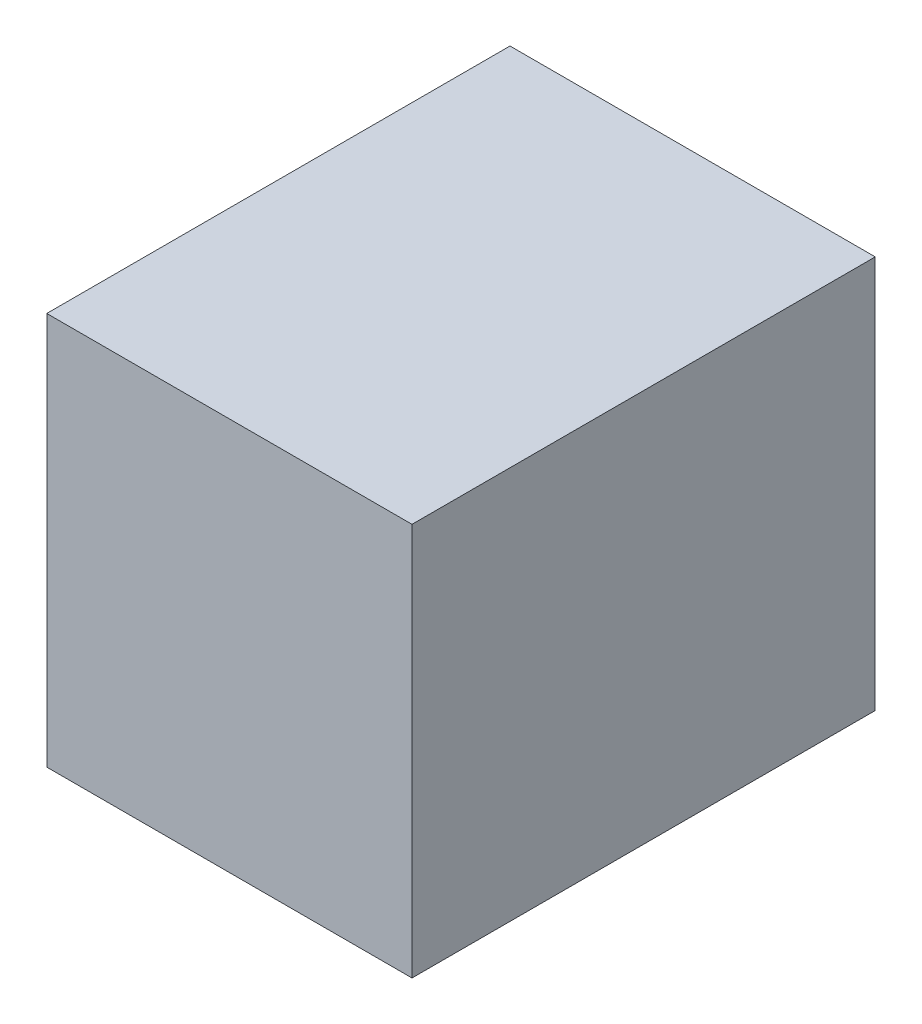
ISO-10303-21;
HEADER;
FILE_DESCRIPTION(('STEP AP214'),'2;1');
FILE_NAME('part.step','',(''),(''),'','','');
FILE_SCHEMA(('AUTOMOTIVE_DESIGN { 1 0 10303 214 1 1 1 1 }'));
ENDSEC;
DATA;
#1=APPLICATION_CONTEXT('core data for automotive mechanical design processes');
#2=APPLICATION_PROTOCOL_DEFINITION('international standard','automotive_design',2000,#1);
#3=PRODUCT_CONTEXT('',#1,'mechanical');
#4=PRODUCT('Part','Part','',(#3));
#5=PRODUCT_RELATED_PRODUCT_CATEGORY('part','',(#4));
#6=PRODUCT_DEFINITION_FORMATION('','',#4);
#7=PRODUCT_DEFINITION_CONTEXT('part definition',#1,'design');
#8=PRODUCT_DEFINITION('design','',#6,#7);
#9=PRODUCT_DEFINITION_SHAPE('','',#8);
#10=(LENGTH_UNIT() NAMED_UNIT(*) SI_UNIT(.MILLI.,.METRE.));
#11=(NAMED_UNIT(*) PLANE_ANGLE_UNIT() SI_UNIT($,.RADIAN.));
#12=(NAMED_UNIT(*) SI_UNIT($,.STERADIAN.) SOLID_ANGLE_UNIT());
#13=UNCERTAINTY_MEASURE_WITH_UNIT(LENGTH_MEASURE(1.E-05),#10,'distance_accuracy_value','');
#14=(GEOMETRIC_REPRESENTATION_CONTEXT(3) GLOBAL_UNCERTAINTY_ASSIGNED_CONTEXT((#13)) GLOBAL_UNIT_ASSIGNED_CONTEXT((#10,
#11,#12)) REPRESENTATION_CONTEXT('',''));
#15=CARTESIAN_POINT('',(0.,0.,0.));
#16=DIRECTION('',(0.,0.,1.));
#17=DIRECTION('',(1.,0.,0.));
#18=AXIS2_PLACEMENT_3D('',#15,#16,#17);
#19=CARTESIAN_POINT('',(-300.,0.,-500.));
#20=DIRECTION('',(1.,0.,0.));
#21=DIRECTION('',(0.,1.,0.));
#22=AXIS2_PLACEMENT_3D('',#19,#20,#21);
#23=PLANE('',#22);
#24=DIRECTION('',(0.,1.,0.));
#25=VECTOR('',#24,1.);
#26=CARTESIAN_POINT('',(-300.,0.,10.));
#27=LINE('',#26,#25);
#28=CARTESIAN_POINT('',(-300.,-120.526315789474,10.));
#29=VERTEX_POINT('',#28);
#30=CARTESIAN_POINT('',(-300.,320.526315789474,10.));
#31=VERTEX_POINT('',#30);
#32=EDGE_CURVE('E158',#29,#31,#27,.T.);
#33=ORIENTED_EDGE('',*,*,#32,.T.);
#34=DIRECTION('',(0.,0.,1.));
#35=VECTOR('',#34,1.);
#36=CARTESIAN_POINT('',(-300.,320.526315789474,-500.));
#37=LINE('',#36,#35);
#38=CARTESIAN_POINT('',(-300.,320.526315789474,-510.));
#39=VERTEX_POINT('',#38);
#40=EDGE_CURVE('E156',#39,#31,#37,.T.);
#41=ORIENTED_EDGE('',*,*,#40,.F.);
#42=DIRECTION('',(0.,1.,0.));
#43=VECTOR('',#42,1.);
#44=CARTESIAN_POINT('',(-300.,0.,-510.));
#45=LINE('',#44,#43);
#46=CARTESIAN_POINT('',(-300.,-120.526315789474,-510.));
#47=VERTEX_POINT('',#46);
#48=EDGE_CURVE('E37',#47,#39,#45,.T.);
#49=ORIENTED_EDGE('',*,*,#48,.F.);
#50=DIRECTION('',(0.,0.,1.));
#51=VECTOR('',#50,1.);
#52=CARTESIAN_POINT('',(-300.,-120.526315789474,-500.));
#53=LINE('',#52,#51);
#54=EDGE_CURVE('E42',#47,#29,#53,.T.);
#55=ORIENTED_EDGE('',*,*,#54,.T.);
#56=EDGE_LOOP('',(#33,#41,#49,#55));
#57=FACE_BOUND('',#56,.T.);
#58=DIRECTION('',(0.,1.,0.));
#59=VECTOR('',#58,1.);
#60=CARTESIAN_POINT('',(-300.,0.,0.));
#61=LINE('',#60,#59);
#62=CARTESIAN_POINT('',(-300.,-110.526315789474,0.));
#63=VERTEX_POINT('',#62);
#64=CARTESIAN_POINT('',(-300.,310.526315789474,0.));
#65=VERTEX_POINT('',#64);
#66=EDGE_CURVE('E138',#63,#65,#61,.T.);
#67=ORIENTED_EDGE('',*,*,#66,.F.);
#68=DIRECTION('',(0.,0.,1.));
#69=VECTOR('',#68,1.);
#70=CARTESIAN_POINT('',(-300.,-110.526315789474,-500.));
#71=LINE('',#70,#69);
#72=CARTESIAN_POINT('',(-300.,-110.526315789474,-500.));
#73=VERTEX_POINT('',#72);
#74=EDGE_CURVE('E144',#73,#63,#71,.T.);
#75=ORIENTED_EDGE('',*,*,#74,.F.);
#76=DIRECTION('',(0.,1.,0.));
#77=VECTOR('',#76,1.);
#78=CARTESIAN_POINT('',(-300.,0.,-500.));
#79=LINE('',#78,#77);
#80=CARTESIAN_POINT('',(-300.,310.526315789474,-500.));
#81=VERTEX_POINT('',#80);
#82=EDGE_CURVE('E50',#73,#81,#79,.T.);
#83=ORIENTED_EDGE('',*,*,#82,.T.);
#84=DIRECTION('',(0.,0.,1.));
#85=VECTOR('',#84,1.);
#86=CARTESIAN_POINT('',(-300.,310.526315789474,-500.));
#87=LINE('',#86,#85);
#88=EDGE_CURVE('E122',#81,#65,#87,.T.);
#89=ORIENTED_EDGE('',*,*,#88,.T.);
#90=EDGE_LOOP('',(#67,#75,#83,#89));
#91=FACE_BOUND('',#90,.T.);
#92=ADVANCED_FACE('F33',(#57,#91),#23,.F.);
#93=CARTESIAN_POINT('',(110.,0.,-500.));
#94=DIRECTION('',(-1.,0.,0.));
#95=DIRECTION('',(0.,-1.,0.));
#96=AXIS2_PLACEMENT_3D('',#93,#94,#95);
#97=PLANE('',#96);
#98=DIRECTION('',(0.,-1.,0.));
#99=VECTOR('',#98,1.);
#100=CARTESIAN_POINT('',(110.,0.,10.));
#101=LINE('',#100,#99);
#102=CARTESIAN_POINT('',(110.,320.526315789474,10.));
#103=VERTEX_POINT('',#102);
#104=CARTESIAN_POINT('',(110.,-120.526315789474,10.));
#105=VERTEX_POINT('',#104);
#106=EDGE_CURVE('E143',#103,#105,#101,.T.);
#107=ORIENTED_EDGE('',*,*,#106,.T.);
#108=DIRECTION('',(0.,0.,1.));
#109=VECTOR('',#108,1.);
#110=CARTESIAN_POINT('',(110.,-120.526315789474,-500.));
#111=LINE('',#110,#109);
#112=CARTESIAN_POINT('',(110.,-120.526315789474,-510.));
#113=VERTEX_POINT('',#112);
#114=EDGE_CURVE('E11',#113,#105,#111,.T.);
#115=ORIENTED_EDGE('',*,*,#114,.F.);
#116=DIRECTION('',(0.,-1.,0.));
#117=VECTOR('',#116,1.);
#118=CARTESIAN_POINT('',(110.,0.,-510.));
#119=LINE('',#118,#117);
#120=CARTESIAN_POINT('',(110.,320.526315789474,-510.));
#121=VERTEX_POINT('',#120);
#122=EDGE_CURVE('E151',#121,#113,#119,.T.);
#123=ORIENTED_EDGE('',*,*,#122,.F.);
#124=DIRECTION('',(0.,0.,1.));
#125=VECTOR('',#124,1.);
#126=CARTESIAN_POINT('',(110.,320.526315789474,-500.));
#127=LINE('',#126,#125);
#128=EDGE_CURVE('E83',#121,#103,#127,.T.);
#129=ORIENTED_EDGE('',*,*,#128,.T.);
#130=EDGE_LOOP('',(#107,#115,#123,#129));
#131=FACE_BOUND('',#130,.T.);
#132=ADVANCED_FACE('F174',(#131),#97,.F.);
#133=CARTESIAN_POINT('',(0.,-120.526315789474,-500.));
#134=DIRECTION('',(0.,1.,0.));
#135=DIRECTION('',(-1.,0.,0.));
#136=AXIS2_PLACEMENT_3D('',#133,#134,#135);
#137=PLANE('',#136);
#138=DIRECTION('',(-1.,0.,0.));
#139=VECTOR('',#138,1.);
#140=CARTESIAN_POINT('',(0.,-120.526315789474,10.));
#141=LINE('',#140,#139);
#142=EDGE_CURVE('E154',#105,#29,#141,.T.);
#143=ORIENTED_EDGE('',*,*,#142,.T.);
#144=ORIENTED_EDGE('',*,*,#54,.F.);
#145=DIRECTION('',(-1.,0.,0.));
#146=VECTOR('',#145,1.);
#147=CARTESIAN_POINT('',(0.,-120.526315789474,-510.));
#148=LINE('',#147,#146);
#149=EDGE_CURVE('E58',#113,#47,#148,.T.);
#150=ORIENTED_EDGE('',*,*,#149,.F.);
#151=ORIENTED_EDGE('',*,*,#114,.T.);
#152=EDGE_LOOP('',(#143,#144,#150,#151));
#153=FACE_BOUND('',#152,.T.);
#154=ADVANCED_FACE('F181',(#153),#137,.F.);
#155=CARTESIAN_POINT('',(0.,320.526315789474,-500.));
#156=DIRECTION('',(0.,1.,0.));
#157=DIRECTION('',(0.,0.,1.));
#158=AXIS2_PLACEMENT_3D('',#155,#156,#157);
#159=PLANE('',#158);
#160=DIRECTION('',(-1.,0.,0.));
#161=VECTOR('',#160,1.);
#162=CARTESIAN_POINT('',(0.,320.526315789474,10.));
#163=LINE('',#162,#161);
#164=EDGE_CURVE('E149',#103,#31,#163,.T.);
#165=ORIENTED_EDGE('',*,*,#164,.F.);
#166=ORIENTED_EDGE('',*,*,#128,.F.);
#167=DIRECTION('',(-1.,0.,0.));
#168=VECTOR('',#167,1.);
#169=CARTESIAN_POINT('',(0.,320.526315789474,-510.));
#170=LINE('',#169,#168);
#171=EDGE_CURVE('E153',#121,#39,#170,.T.);
#172=ORIENTED_EDGE('',*,*,#171,.T.);
#173=ORIENTED_EDGE('',*,*,#40,.T.);
#174=EDGE_LOOP('',(#165,#166,#172,#173));
#175=FACE_BOUND('',#174,.T.);
#176=ADVANCED_FACE('F166',(#175),#159,.T.);
#177=CARTESIAN_POINT('',(0.,0.,-510.));
#178=DIRECTION('',(0.,0.,1.));
#179=DIRECTION('',(1.,0.,0.));
#180=AXIS2_PLACEMENT_3D('',#177,#178,#179);
#181=PLANE('',#180);
#182=ORIENTED_EDGE('',*,*,#122,.T.);
#183=ORIENTED_EDGE('',*,*,#149,.T.);
#184=ORIENTED_EDGE('',*,*,#48,.T.);
#185=ORIENTED_EDGE('',*,*,#171,.F.);
#186=EDGE_LOOP('',(#182,#183,#184,#185));
#187=FACE_BOUND('',#186,.T.);
#188=ADVANCED_FACE('F175',(#187),#181,.F.);
#189=CARTESIAN_POINT('',(0.,0.,10.));
#190=DIRECTION('',(0.,0.,1.));
#191=DIRECTION('',(1.,0.,0.));
#192=AXIS2_PLACEMENT_3D('',#189,#190,#191);
#193=PLANE('',#192);
#194=ORIENTED_EDGE('',*,*,#106,.F.);
#195=ORIENTED_EDGE('',*,*,#164,.T.);
#196=ORIENTED_EDGE('',*,*,#32,.F.);
#197=ORIENTED_EDGE('',*,*,#142,.F.);
#198=EDGE_LOOP('',(#194,#195,#196,#197));
#199=FACE_BOUND('',#198,.T.);
#200=ADVANCED_FACE('F35',(#199),#193,.T.);
#201=CARTESIAN_POINT('',(100.,0.,-500.));
#202=DIRECTION('',(-1.,0.,0.));
#203=DIRECTION('',(0.,-1.,0.));
#204=AXIS2_PLACEMENT_3D('',#201,#202,#203);
#205=PLANE('',#204);
#206=DIRECTION('',(0.,-1.,0.));
#207=VECTOR('',#206,1.);
#208=CARTESIAN_POINT('',(100.,0.,0.));
#209=LINE('',#208,#207);
#210=CARTESIAN_POINT('',(100.,310.526315789474,0.));
#211=VERTEX_POINT('',#210);
#212=CARTESIAN_POINT('',(100.,-110.526315789474,0.));
#213=VERTEX_POINT('',#212);
#214=EDGE_CURVE('E117',#211,#213,#209,.T.);
#215=ORIENTED_EDGE('',*,*,#214,.F.);
#216=DIRECTION('',(0.,0.,1.));
#217=VECTOR('',#216,1.);
#218=CARTESIAN_POINT('',(100.,310.526315789474,-500.));
#219=LINE('',#218,#217);
#220=CARTESIAN_POINT('',(100.,310.526315789474,-500.));
#221=VERTEX_POINT('',#220);
#222=EDGE_CURVE('E110',#221,#211,#219,.T.);
#223=ORIENTED_EDGE('',*,*,#222,.F.);
#224=DIRECTION('',(0.,-1.,0.));
#225=VECTOR('',#224,1.);
#226=CARTESIAN_POINT('',(100.,0.,-500.));
#227=LINE('',#226,#225);
#228=CARTESIAN_POINT('',(100.,-110.526315789474,-500.));
#229=VERTEX_POINT('',#228);
#230=EDGE_CURVE('E114',#221,#229,#227,.T.);
#231=ORIENTED_EDGE('',*,*,#230,.T.);
#232=DIRECTION('',(0.,0.,1.));
#233=VECTOR('',#232,1.);
#234=CARTESIAN_POINT('',(100.,-110.526315789474,-500.));
#235=LINE('',#234,#233);
#236=EDGE_CURVE('E141',#229,#213,#235,.T.);
#237=ORIENTED_EDGE('',*,*,#236,.T.);
#238=EDGE_LOOP('',(#215,#223,#231,#237));
#239=FACE_BOUND('',#238,.T.);
#240=ADVANCED_FACE('F112',(#239),#205,.T.);
#241=CARTESIAN_POINT('',(0.,-110.526315789474,-500.));
#242=DIRECTION('',(0.,1.,0.));
#243=DIRECTION('',(-1.,0.,0.));
#244=AXIS2_PLACEMENT_3D('',#241,#242,#243);
#245=PLANE('',#244);
#246=DIRECTION('',(-1.,0.,0.));
#247=VECTOR('',#246,1.);
#248=CARTESIAN_POINT('',(0.,-110.526315789474,0.));
#249=LINE('',#248,#247);
#250=EDGE_CURVE('E127',#213,#63,#249,.T.);
#251=ORIENTED_EDGE('',*,*,#250,.F.);
#252=ORIENTED_EDGE('',*,*,#236,.F.);
#253=DIRECTION('',(-1.,0.,0.));
#254=VECTOR('',#253,1.);
#255=CARTESIAN_POINT('',(0.,-110.526315789474,-500.));
#256=LINE('',#255,#254);
#257=EDGE_CURVE('E123',#229,#73,#256,.T.);
#258=ORIENTED_EDGE('',*,*,#257,.T.);
#259=ORIENTED_EDGE('',*,*,#74,.T.);
#260=EDGE_LOOP('',(#251,#252,#258,#259));
#261=FACE_BOUND('',#260,.T.);
#262=ADVANCED_FACE('F220',(#261),#245,.T.);
#263=CARTESIAN_POINT('',(0.,310.526315789474,-500.));
#264=DIRECTION('',(0.,1.,0.));
#265=DIRECTION('',(0.,0.,1.));
#266=AXIS2_PLACEMENT_3D('',#263,#264,#265);
#267=PLANE('',#266);
#268=DIRECTION('',(-1.,0.,0.));
#269=VECTOR('',#268,1.);
#270=CARTESIAN_POINT('',(0.,310.526315789474,0.));
#271=LINE('',#270,#269);
#272=EDGE_CURVE('E136',#211,#65,#271,.T.);
#273=ORIENTED_EDGE('',*,*,#272,.T.);
#274=ORIENTED_EDGE('',*,*,#88,.F.);
#275=DIRECTION('',(-1.,0.,0.));
#276=VECTOR('',#275,1.);
#277=CARTESIAN_POINT('',(0.,310.526315789474,-500.));
#278=LINE('',#277,#276);
#279=EDGE_CURVE('E126',#221,#81,#278,.T.);
#280=ORIENTED_EDGE('',*,*,#279,.F.);
#281=ORIENTED_EDGE('',*,*,#222,.T.);
#282=EDGE_LOOP('',(#273,#274,#280,#281));
#283=FACE_BOUND('',#282,.T.);
#284=ADVANCED_FACE('F129',(#283),#267,.F.);
#285=CARTESIAN_POINT('',(0.,0.,-500.));
#286=DIRECTION('',(0.,0.,1.));
#287=DIRECTION('',(1.,0.,0.));
#288=AXIS2_PLACEMENT_3D('',#285,#286,#287);
#289=PLANE('',#288);
#290=ORIENTED_EDGE('',*,*,#230,.F.);
#291=ORIENTED_EDGE('',*,*,#279,.T.);
#292=ORIENTED_EDGE('',*,*,#82,.F.);
#293=ORIENTED_EDGE('',*,*,#257,.F.);
#294=EDGE_LOOP('',(#290,#291,#292,#293));
#295=FACE_BOUND('',#294,.T.);
#296=ADVANCED_FACE('F125',(#295),#289,.T.);
#297=CARTESIAN_POINT('',(0.,0.,0.));
#298=DIRECTION('',(0.,0.,1.));
#299=DIRECTION('',(1.,0.,0.));
#300=AXIS2_PLACEMENT_3D('',#297,#298,#299);
#301=PLANE('',#300);
#302=ORIENTED_EDGE('',*,*,#214,.T.);
#303=ORIENTED_EDGE('',*,*,#250,.T.);
#304=ORIENTED_EDGE('',*,*,#66,.T.);
#305=ORIENTED_EDGE('',*,*,#272,.F.);
#306=EDGE_LOOP('',(#302,#303,#304,#305));
#307=FACE_BOUND('',#306,.T.);
#308=ADVANCED_FACE('F245',(#307),#301,.F.);
#309=CLOSED_SHELL('',(#92,#132,#154,#176,#188,#200,#240,#262,#284,#296,#308));
#310=MANIFOLD_SOLID_BREP('B2',#309);
#311=ADVANCED_BREP_SHAPE_REPRESENTATION('',(#18,#310),#14);
#312=SHAPE_DEFINITION_REPRESENTATION(#9,#311);
ENDSEC;
END-ISO-10303-21;
